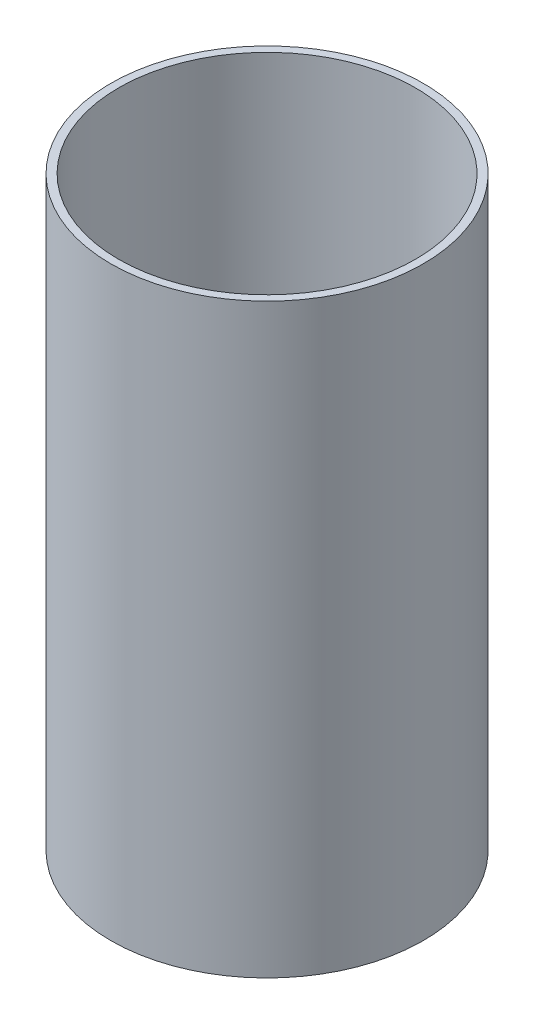
ISO-10303-21;
HEADER;
FILE_DESCRIPTION(('STEP AP214'),'2;1');
FILE_NAME('part.step','',(''),(''),'','','');
FILE_SCHEMA(('AUTOMOTIVE_DESIGN { 1 0 10303 214 1 1 1 1 }'));
ENDSEC;
DATA;
#1=APPLICATION_CONTEXT('core data for automotive mechanical design processes');
#2=APPLICATION_PROTOCOL_DEFINITION('international standard','automotive_design',2000,#1);
#3=PRODUCT_CONTEXT('',#1,'mechanical');
#4=PRODUCT('Part','Part','',(#3));
#5=PRODUCT_RELATED_PRODUCT_CATEGORY('part','',(#4));
#6=PRODUCT_DEFINITION_FORMATION('','',#4);
#7=PRODUCT_DEFINITION_CONTEXT('part definition',#1,'design');
#8=PRODUCT_DEFINITION('design','',#6,#7);
#9=PRODUCT_DEFINITION_SHAPE('','',#8);
#10=(LENGTH_UNIT() NAMED_UNIT(*) SI_UNIT(.MILLI.,.METRE.));
#11=(NAMED_UNIT(*) PLANE_ANGLE_UNIT() SI_UNIT($,.RADIAN.));
#12=(NAMED_UNIT(*) SI_UNIT($,.STERADIAN.) SOLID_ANGLE_UNIT());
#13=UNCERTAINTY_MEASURE_WITH_UNIT(LENGTH_MEASURE(1.E-05),#10,'distance_accuracy_value','');
#14=(GEOMETRIC_REPRESENTATION_CONTEXT(3) GLOBAL_UNCERTAINTY_ASSIGNED_CONTEXT((#13)) GLOBAL_UNIT_ASSIGNED_CONTEXT((#10,
#11,#12)) REPRESENTATION_CONTEXT('',''));
#15=CARTESIAN_POINT('',(0.,0.,0.));
#16=DIRECTION('',(0.,0.,1.));
#17=DIRECTION('',(1.,0.,0.));
#18=AXIS2_PLACEMENT_3D('',#15,#16,#17);
#19=CARTESIAN_POINT('',(0.,150.,0.));
#20=DIRECTION('',(0.,1.,0.));
#21=DIRECTION('',(0.,0.,1.));
#22=AXIS2_PLACEMENT_3D('',#19,#20,#21);
#23=PLANE('',#22);
#24=CARTESIAN_POINT('',(0.,150.,0.));
#25=DIRECTION('',(0.,1.,0.));
#26=DIRECTION('',(0.,0.,1.));
#27=AXIS2_PLACEMENT_3D('',#24,#25,#26);
#28=CIRCLE('',#27,40.);
#29=CARTESIAN_POINT('',(0.,150.,40.));
#30=VERTEX_POINT('',#29);
#31=EDGE_CURVE('E10',#30,#30,#28,.T.);
#32=ORIENTED_EDGE('',*,*,#31,.T.);
#33=EDGE_LOOP('',(#32));
#34=FACE_BOUND('',#33,.T.);
#35=CARTESIAN_POINT('',(0.,150.,0.));
#36=DIRECTION('',(0.,1.,0.));
#37=DIRECTION('',(0.,0.,1.));
#38=AXIS2_PLACEMENT_3D('',#35,#36,#37);
#39=CIRCLE('',#38,38.);
#40=CARTESIAN_POINT('',(0.,150.,38.));
#41=VERTEX_POINT('',#40);
#42=EDGE_CURVE('E44',#41,#41,#39,.T.);
#43=ORIENTED_EDGE('',*,*,#42,.F.);
#44=EDGE_LOOP('',(#43));
#45=FACE_BOUND('',#44,.T.);
#46=ADVANCED_FACE('F33',(#34,#45),#23,.T.);
#47=CARTESIAN_POINT('',(0.,0.,0.));
#48=DIRECTION('',(0.,1.,0.));
#49=DIRECTION('',(0.,0.,1.));
#50=AXIS2_PLACEMENT_3D('',#47,#48,#49);
#51=PLANE('',#50);
#52=CARTESIAN_POINT('',(0.,0.,0.));
#53=DIRECTION('',(0.,1.,0.));
#54=DIRECTION('',(0.,0.,1.));
#55=AXIS2_PLACEMENT_3D('',#52,#53,#54);
#56=CIRCLE('',#55,40.);
#57=CARTESIAN_POINT('',(0.,0.,40.));
#58=VERTEX_POINT('',#57);
#59=EDGE_CURVE('E37',#58,#58,#56,.T.);
#60=ORIENTED_EDGE('',*,*,#59,.F.);
#61=EDGE_LOOP('',(#60));
#62=FACE_BOUND('',#61,.T.);
#63=CARTESIAN_POINT('',(0.,0.,0.));
#64=DIRECTION('',(0.,1.,0.));
#65=DIRECTION('',(0.,0.,1.));
#66=AXIS2_PLACEMENT_3D('',#63,#64,#65);
#67=CIRCLE('',#66,38.);
#68=CARTESIAN_POINT('',(0.,0.,38.));
#69=VERTEX_POINT('',#68);
#70=EDGE_CURVE('E46',#69,#69,#67,.T.);
#71=ORIENTED_EDGE('',*,*,#70,.T.);
#72=EDGE_LOOP('',(#71));
#73=FACE_BOUND('',#72,.T.);
#74=ADVANCED_FACE('F56',(#62,#73),#51,.F.);
#75=CARTESIAN_POINT('',(0.,150.,0.));
#76=DIRECTION('',(0.,-1.,0.));
#77=DIRECTION('',(0.,0.,-1.));
#78=AXIS2_PLACEMENT_3D('',#75,#76,#77);
#79=CYLINDRICAL_SURFACE('',#78,40.);
#80=ORIENTED_EDGE('',*,*,#31,.F.);
#81=EDGE_LOOP('',(#80));
#82=FACE_BOUND('',#81,.T.);
#83=ORIENTED_EDGE('',*,*,#59,.T.);
#84=EDGE_LOOP('',(#83));
#85=FACE_BOUND('',#84,.T.);
#86=ADVANCED_FACE('F35',(#82,#85),#79,.T.);
#87=CARTESIAN_POINT('',(0.,150.,0.));
#88=DIRECTION('',(0.,-1.,0.));
#89=DIRECTION('',(0.,0.,-1.));
#90=AXIS2_PLACEMENT_3D('',#87,#88,#89);
#91=CYLINDRICAL_SURFACE('',#90,38.);
#92=ORIENTED_EDGE('',*,*,#42,.T.);
#93=EDGE_LOOP('',(#92));
#94=FACE_BOUND('',#93,.T.);
#95=ORIENTED_EDGE('',*,*,#70,.F.);
#96=EDGE_LOOP('',(#95));
#97=FACE_BOUND('',#96,.T.);
#98=ADVANCED_FACE('F52',(#94,#97),#91,.F.);
#99=CLOSED_SHELL('',(#46,#74,#86,#98));
#100=MANIFOLD_SOLID_BREP('B2',#99);
#101=ADVANCED_BREP_SHAPE_REPRESENTATION('',(#18,#100),#14);
#102=SHAPE_DEFINITION_REPRESENTATION(#9,#101);
ENDSEC;
END-ISO-10303-21;
